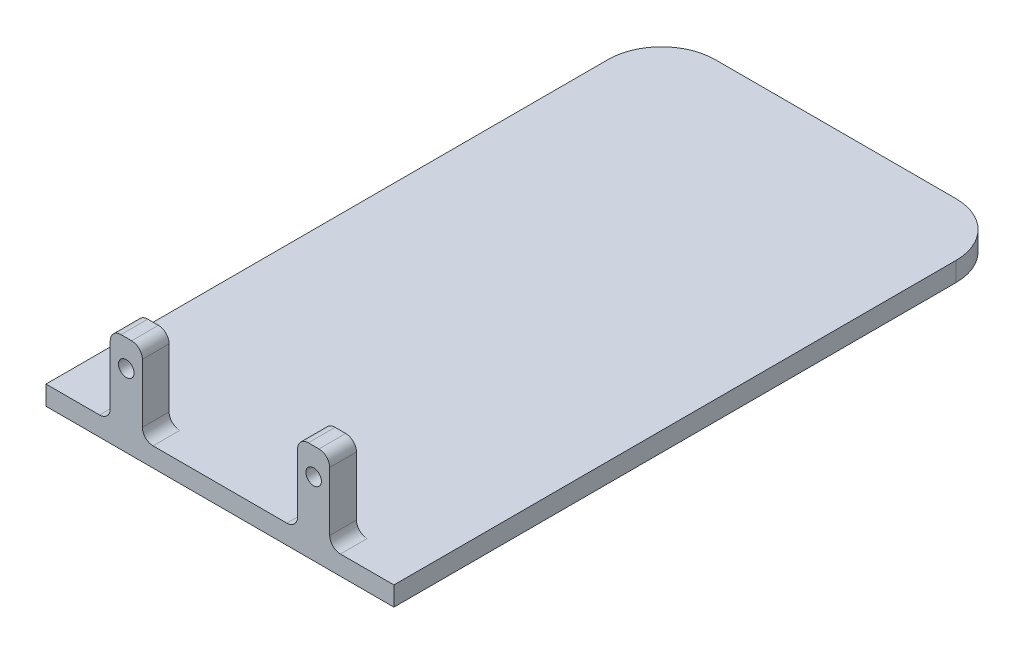
ISO-10303-21;
HEADER;
FILE_DESCRIPTION(('STEP AP214'),'2;1');
FILE_NAME('part.step','',(''),(''),'','','');
FILE_SCHEMA(('AUTOMOTIVE_DESIGN { 1 0 10303 214 1 1 1 1 }'));
ENDSEC;
DATA;
#1=APPLICATION_CONTEXT('core data for automotive mechanical design processes');
#2=APPLICATION_PROTOCOL_DEFINITION('international standard','automotive_design',2000,#1);
#3=PRODUCT_CONTEXT('',#1,'mechanical');
#4=PRODUCT('Part','Part','',(#3));
#5=PRODUCT_RELATED_PRODUCT_CATEGORY('part','',(#4));
#6=PRODUCT_DEFINITION_FORMATION('','',#4);
#7=PRODUCT_DEFINITION_CONTEXT('part definition',#1,'design');
#8=PRODUCT_DEFINITION('design','',#6,#7);
#9=PRODUCT_DEFINITION_SHAPE('','',#8);
#10=(LENGTH_UNIT() NAMED_UNIT(*) SI_UNIT(.MILLI.,.METRE.));
#11=(NAMED_UNIT(*) PLANE_ANGLE_UNIT() SI_UNIT($,.RADIAN.));
#12=(NAMED_UNIT(*) SI_UNIT($,.STERADIAN.) SOLID_ANGLE_UNIT());
#13=UNCERTAINTY_MEASURE_WITH_UNIT(LENGTH_MEASURE(1.E-05),#10,'distance_accuracy_value','');
#14=(GEOMETRIC_REPRESENTATION_CONTEXT(3) GLOBAL_UNCERTAINTY_ASSIGNED_CONTEXT((#13)) GLOBAL_UNIT_ASSIGNED_CONTEXT((#10,
#11,#12)) REPRESENTATION_CONTEXT('',''));
#15=CARTESIAN_POINT('',(0.,0.,0.));
#16=DIRECTION('',(0.,0.,1.));
#17=DIRECTION('',(1.,0.,0.));
#18=AXIS2_PLACEMENT_3D('',#15,#16,#17);
#19=CARTESIAN_POINT('',(-38.0503105288509,3.6,-26.0406812681823));
#20=DIRECTION('',(1.,0.,0.));
#21=DIRECTION('',(0.,0.,-1.));
#22=AXIS2_PLACEMENT_3D('',#19,#20,#21);
#23=PLANE('',#22);
#24=DIRECTION('',(0.,0.,1.));
#25=VECTOR('',#24,1.);
#26=CARTESIAN_POINT('',(-38.0503105288509,3.6,-26.0406812681823));
#27=LINE('',#26,#25);
#28=CARTESIAN_POINT('',(-38.0503105288509,3.6,-16.0406812681823));
#29=VERTEX_POINT('',#28);
#30=CARTESIAN_POINT('',(-38.0503105288509,3.6,88.9593187318177));
#31=VERTEX_POINT('',#30);
#32=EDGE_CURVE('E183',#29,#31,#27,.T.);
#33=ORIENTED_EDGE('',*,*,#32,.F.);
#34=DIRECTION('',(0.,-1.,0.));
#35=VECTOR('',#34,1.);
#36=CARTESIAN_POINT('',(-38.0503105288509,3.6,-16.0406812681823));
#37=LINE('',#36,#35);
#38=CARTESIAN_POINT('',(-38.0503105288509,0.,-16.0406812681823));
#39=VERTEX_POINT('',#38);
#40=EDGE_CURVE('E233',#29,#39,#37,.T.);
#41=ORIENTED_EDGE('',*,*,#40,.T.);
#42=DIRECTION('',(0.,0.,1.));
#43=VECTOR('',#42,1.);
#44=CARTESIAN_POINT('',(-38.0503105288509,0.,-26.0406812681823));
#45=LINE('',#44,#43);
#46=CARTESIAN_POINT('',(-38.0503105288509,0.,88.9593187318177));
#47=VERTEX_POINT('',#46);
#48=EDGE_CURVE('E210',#39,#47,#45,.T.);
#49=ORIENTED_EDGE('',*,*,#48,.T.);
#50=DIRECTION('',(0.,-1.,0.));
#51=VECTOR('',#50,1.);
#52=CARTESIAN_POINT('',(-38.0503105288509,3.6,88.9593187318177));
#53=LINE('',#52,#51);
#54=EDGE_CURVE('E204',#31,#47,#53,.T.);
#55=ORIENTED_EDGE('',*,*,#54,.F.);
#56=EDGE_LOOP('',(#33,#41,#49,#55));
#57=FACE_BOUND('',#56,.T.);
#58=ADVANCED_FACE('F33',(#57),#23,.F.);
#59=CARTESIAN_POINT('',(-38.0503105288509,3.6,88.9593187318177));
#60=DIRECTION('',(0.,0.,-1.));
#61=DIRECTION('',(-1.,0.,0.));
#62=AXIS2_PLACEMENT_3D('',#59,#60,#61);
#63=PLANE('',#62);
#64=DIRECTION('',(-1.,0.,0.));
#65=VECTOR('',#64,1.);
#66=CARTESIAN_POINT('',(14.9496894711491,18.6,88.9593187318177));
#67=LINE('',#66,#65);
#68=CARTESIAN_POINT('',(12.9496894711491,18.6,88.9593187318177));
#69=VERTEX_POINT('',#68);
#70=CARTESIAN_POINT('',(10.9496894711491,18.6,88.9593187318177));
#71=VERTEX_POINT('',#70);
#72=EDGE_CURVE('E424',#69,#71,#67,.T.);
#73=ORIENTED_EDGE('',*,*,#72,.T.);
#74=CARTESIAN_POINT('',(10.9496894711491,16.6,88.9593187318177));
#75=DIRECTION('',(0.,0.,-1.));
#76=DIRECTION('',(-1.,0.,0.));
#77=AXIS2_PLACEMENT_3D('',#74,#75,#76);
#78=CIRCLE('',#77,2.);
#79=CARTESIAN_POINT('',(8.9496894711491,16.6,88.9593187318177));
#80=VERTEX_POINT('',#79);
#81=EDGE_CURVE('E277',#71,#80,#78,.F.);
#82=ORIENTED_EDGE('',*,*,#81,.T.);
#83=DIRECTION('',(0.,-1.,0.));
#84=VECTOR('',#83,1.);
#85=CARTESIAN_POINT('',(8.9496894711491,3.6,88.9593187318177));
#86=LINE('',#85,#84);
#87=CARTESIAN_POINT('',(8.9496894711491,5.6,88.9593187318177));
#88=VERTEX_POINT('',#87);
#89=EDGE_CURVE('E324',#80,#88,#86,.T.);
#90=ORIENTED_EDGE('',*,*,#89,.T.);
#91=CARTESIAN_POINT('',(6.9496894711491,5.6,88.9593187318177));
#92=DIRECTION('',(0.,0.,-1.));
#93=DIRECTION('',(-1.,0.,0.));
#94=AXIS2_PLACEMENT_3D('',#91,#92,#93);
#95=CIRCLE('',#94,2.);
#96=CARTESIAN_POINT('',(6.9496894711491,3.6,88.9593187318177));
#97=VERTEX_POINT('',#96);
#98=EDGE_CURVE('E300',#88,#97,#95,.T.);
#99=ORIENTED_EDGE('',*,*,#98,.T.);
#100=DIRECTION('',(1.,0.,0.));
#101=VECTOR('',#100,1.);
#102=CARTESIAN_POINT('',(-38.0503105288509,3.6,88.9593187318177));
#103=LINE('',#102,#101);
#104=CARTESIAN_POINT('',(-18.0503105288509,3.6,88.9593187318177));
#105=VERTEX_POINT('',#104);
#106=EDGE_CURVE('E207',#105,#97,#103,.T.);
#107=ORIENTED_EDGE('',*,*,#106,.F.);
#108=CARTESIAN_POINT('',(-18.0503105288509,5.6,88.9593187318177));
#109=DIRECTION('',(0.,0.,-1.));
#110=DIRECTION('',(-1.,0.,0.));
#111=AXIS2_PLACEMENT_3D('',#108,#109,#110);
#112=CIRCLE('',#111,2.);
#113=CARTESIAN_POINT('',(-20.0503105288509,5.6,88.9593187318177));
#114=VERTEX_POINT('',#113);
#115=EDGE_CURVE('E295',#105,#114,#112,.T.);
#116=ORIENTED_EDGE('',*,*,#115,.T.);
#117=DIRECTION('',(0.,1.,0.));
#118=VECTOR('',#117,1.);
#119=CARTESIAN_POINT('',(-20.0503105288509,3.6,88.9593187318177));
#120=LINE('',#119,#118);
#121=CARTESIAN_POINT('',(-20.0503105288509,16.6,88.9593187318177));
#122=VERTEX_POINT('',#121);
#123=EDGE_CURVE('E455',#114,#122,#120,.T.);
#124=ORIENTED_EDGE('',*,*,#123,.T.);
#125=CARTESIAN_POINT('',(-22.0503105288509,16.6,88.9593187318177));
#126=DIRECTION('',(0.,0.,-1.));
#127=DIRECTION('',(-1.,0.,0.));
#128=AXIS2_PLACEMENT_3D('',#125,#126,#127);
#129=CIRCLE('',#128,2.);
#130=CARTESIAN_POINT('',(-22.0503105288509,18.6,88.9593187318177));
#131=VERTEX_POINT('',#130);
#132=EDGE_CURVE('E273',#122,#131,#129,.F.);
#133=ORIENTED_EDGE('',*,*,#132,.T.);
#134=DIRECTION('',(-1.,0.,0.));
#135=VECTOR('',#134,1.);
#136=CARTESIAN_POINT('',(-26.0503105288509,18.6,88.9593187318177));
#137=LINE('',#136,#135);
#138=CARTESIAN_POINT('',(-24.0503105288509,18.6,88.9593187318177));
#139=VERTEX_POINT('',#138);
#140=EDGE_CURVE('E448',#131,#139,#137,.T.);
#141=ORIENTED_EDGE('',*,*,#140,.T.);
#142=CARTESIAN_POINT('',(-24.0503105288509,16.6,88.9593187318177));
#143=DIRECTION('',(0.,0.,-1.));
#144=DIRECTION('',(-1.,0.,0.));
#145=AXIS2_PLACEMENT_3D('',#142,#143,#144);
#146=CIRCLE('',#145,2.);
#147=CARTESIAN_POINT('',(-26.0503105288509,16.6,88.9593187318177));
#148=VERTEX_POINT('',#147);
#149=EDGE_CURVE('E271',#139,#148,#146,.F.);
#150=ORIENTED_EDGE('',*,*,#149,.T.);
#151=DIRECTION('',(0.,-1.,0.));
#152=VECTOR('',#151,1.);
#153=CARTESIAN_POINT('',(-26.0503105288509,3.6,88.9593187318177));
#154=LINE('',#153,#152);
#155=CARTESIAN_POINT('',(-26.0503105288509,5.6,88.9593187318177));
#156=VERTEX_POINT('',#155);
#157=EDGE_CURVE('E441',#148,#156,#154,.T.);
#158=ORIENTED_EDGE('',*,*,#157,.T.);
#159=CARTESIAN_POINT('',(-28.0503105288509,5.6,88.9593187318177));
#160=DIRECTION('',(0.,0.,-1.));
#161=DIRECTION('',(-1.,0.,0.));
#162=AXIS2_PLACEMENT_3D('',#159,#160,#161);
#163=CIRCLE('',#162,2.);
#164=CARTESIAN_POINT('',(-28.0503105288509,3.6,88.9593187318177));
#165=VERTEX_POINT('',#164);
#166=EDGE_CURVE('E41',#156,#165,#163,.T.);
#167=ORIENTED_EDGE('',*,*,#166,.T.);
#168=EDGE_CURVE('E187',#31,#165,#103,.T.);
#169=ORIENTED_EDGE('',*,*,#168,.F.);
#170=ORIENTED_EDGE('',*,*,#54,.T.);
#171=DIRECTION('',(1.,0.,0.));
#172=VECTOR('',#171,1.);
#173=CARTESIAN_POINT('',(-38.0503105288509,0.,88.9593187318177));
#174=LINE('',#173,#172);
#175=CARTESIAN_POINT('',(26.9496894711491,0.,88.9593187318177));
#176=VERTEX_POINT('',#175);
#177=EDGE_CURVE('E332',#47,#176,#174,.T.);
#178=ORIENTED_EDGE('',*,*,#177,.T.);
#179=DIRECTION('',(0.,-1.,0.));
#180=VECTOR('',#179,1.);
#181=CARTESIAN_POINT('',(26.9496894711491,3.6,88.9593187318177));
#182=LINE('',#181,#180);
#183=CARTESIAN_POINT('',(26.9496894711491,3.6,88.9593187318177));
#184=VERTEX_POINT('',#183);
#185=EDGE_CURVE('E213',#184,#176,#182,.T.);
#186=ORIENTED_EDGE('',*,*,#185,.F.);
#187=CARTESIAN_POINT('',(16.9496894711491,3.6,88.9593187318177));
#188=VERTEX_POINT('',#187);
#189=EDGE_CURVE('E196',#188,#184,#103,.T.);
#190=ORIENTED_EDGE('',*,*,#189,.F.);
#191=CARTESIAN_POINT('',(16.9496894711491,5.6,88.9593187318177));
#192=DIRECTION('',(0.,0.,-1.));
#193=DIRECTION('',(-1.,0.,0.));
#194=AXIS2_PLACEMENT_3D('',#191,#192,#193);
#195=CIRCLE('',#194,2.);
#196=CARTESIAN_POINT('',(14.9496894711491,5.6,88.9593187318177));
#197=VERTEX_POINT('',#196);
#198=EDGE_CURVE('E290',#188,#197,#195,.T.);
#199=ORIENTED_EDGE('',*,*,#198,.T.);
#200=DIRECTION('',(0.,1.,0.));
#201=VECTOR('',#200,1.);
#202=CARTESIAN_POINT('',(14.9496894711491,3.6,88.9593187318177));
#203=LINE('',#202,#201);
#204=CARTESIAN_POINT('',(14.9496894711491,16.6,88.9593187318177));
#205=VERTEX_POINT('',#204);
#206=EDGE_CURVE('E420',#197,#205,#203,.T.);
#207=ORIENTED_EDGE('',*,*,#206,.T.);
#208=CARTESIAN_POINT('',(12.9496894711491,16.6,88.9593187318177));
#209=DIRECTION('',(0.,0.,-1.));
#210=DIRECTION('',(-1.,0.,0.));
#211=AXIS2_PLACEMENT_3D('',#208,#209,#210);
#212=CIRCLE('',#211,2.);
#213=EDGE_CURVE('E275',#205,#69,#212,.F.);
#214=ORIENTED_EDGE('',*,*,#213,.T.);
#215=EDGE_LOOP('',(#73,#82,#90,#99,#107,#116,#124,#133,#141,#150,#158,#167,#169,#170,#178,#186,
#190,#199,#207,#214));
#216=FACE_BOUND('',#215,.T.);
#217=CARTESIAN_POINT('',(-23.0503105288509,13.6,88.9593187318177));
#218=DIRECTION('',(0.,0.,1.));
#219=DIRECTION('',(1.,0.,0.));
#220=AXIS2_PLACEMENT_3D('',#217,#218,#219);
#221=CIRCLE('',#220,1.45);
#222=CARTESIAN_POINT('',(-21.6003105288509,13.6,88.9593187318177));
#223=VERTEX_POINT('',#222);
#224=EDGE_CURVE('E434',#223,#223,#221,.T.);
#225=ORIENTED_EDGE('',*,*,#224,.F.);
#226=EDGE_LOOP('',(#225));
#227=FACE_BOUND('',#226,.T.);
#228=CARTESIAN_POINT('',(11.9496894711491,13.6,88.9593187318177));
#229=DIRECTION('',(0.,0.,1.));
#230=DIRECTION('',(-1.,0.,0.));
#231=AXIS2_PLACEMENT_3D('',#228,#229,#230);
#232=CIRCLE('',#231,1.45);
#233=CARTESIAN_POINT('',(10.4996894711491,13.6,88.9593187318177));
#234=VERTEX_POINT('',#233);
#235=EDGE_CURVE('E421',#234,#234,#232,.T.);
#236=ORIENTED_EDGE('',*,*,#235,.F.);
#237=EDGE_LOOP('',(#236));
#238=FACE_BOUND('',#237,.T.);
#239=ADVANCED_FACE('F202',(#216,#227,#238),#63,.F.);
#240=CARTESIAN_POINT('',(26.9496894711491,3.6,-26.0406812681823));
#241=DIRECTION('',(-1.,0.,0.));
#242=DIRECTION('',(0.,0.,1.));
#243=AXIS2_PLACEMENT_3D('',#240,#241,#242);
#244=PLANE('',#243);
#245=DIRECTION('',(0.,0.,-1.));
#246=VECTOR('',#245,1.);
#247=CARTESIAN_POINT('',(26.9496894711491,0.,-26.0406812681823));
#248=LINE('',#247,#246);
#249=CARTESIAN_POINT('',(26.9496894711491,0.,-16.0406812681823));
#250=VERTEX_POINT('',#249);
#251=EDGE_CURVE('E335',#176,#250,#248,.T.);
#252=ORIENTED_EDGE('',*,*,#251,.T.);
#253=DIRECTION('',(0.,-1.,0.));
#254=VECTOR('',#253,1.);
#255=CARTESIAN_POINT('',(26.9496894711491,3.6,-16.0406812681823));
#256=LINE('',#255,#254);
#257=CARTESIAN_POINT('',(26.9496894711491,3.6,-16.0406812681823));
#258=VERTEX_POINT('',#257);
#259=EDGE_CURVE('E228',#250,#258,#256,.F.);
#260=ORIENTED_EDGE('',*,*,#259,.T.);
#261=DIRECTION('',(0.,0.,-1.));
#262=VECTOR('',#261,1.);
#263=CARTESIAN_POINT('',(26.9496894711491,3.6,-26.0406812681823));
#264=LINE('',#263,#262);
#265=EDGE_CURVE('E206',#184,#258,#264,.T.);
#266=ORIENTED_EDGE('',*,*,#265,.F.);
#267=ORIENTED_EDGE('',*,*,#185,.T.);
#268=EDGE_LOOP('',(#252,#260,#266,#267));
#269=FACE_BOUND('',#268,.T.);
#270=ADVANCED_FACE('F353',(#269),#244,.F.);
#271=CARTESIAN_POINT('',(-38.0503105288509,3.6,-26.0406812681823));
#272=DIRECTION('',(0.,0.,1.));
#273=DIRECTION('',(1.,0.,0.));
#274=AXIS2_PLACEMENT_3D('',#271,#272,#273);
#275=PLANE('',#274);
#276=DIRECTION('',(-1.,0.,0.));
#277=VECTOR('',#276,1.);
#278=CARTESIAN_POINT('',(-38.0503105288509,3.6,-26.0406812681823));
#279=LINE('',#278,#277);
#280=CARTESIAN_POINT('',(16.9496894711491,3.6,-26.0406812681823));
#281=VERTEX_POINT('',#280);
#282=CARTESIAN_POINT('',(-28.0503105288509,3.6,-26.0406812681823));
#283=VERTEX_POINT('',#282);
#284=EDGE_CURVE('E218',#281,#283,#279,.T.);
#285=ORIENTED_EDGE('',*,*,#284,.F.);
#286=DIRECTION('',(0.,-1.,0.));
#287=VECTOR('',#286,1.);
#288=CARTESIAN_POINT('',(16.9496894711491,3.6,-26.0406812681823));
#289=LINE('',#288,#287);
#290=CARTESIAN_POINT('',(16.9496894711491,0.,-26.0406812681823));
#291=VERTEX_POINT('',#290);
#292=EDGE_CURVE('E215',#281,#291,#289,.T.);
#293=ORIENTED_EDGE('',*,*,#292,.T.);
#294=DIRECTION('',(-1.,0.,0.));
#295=VECTOR('',#294,1.);
#296=CARTESIAN_POINT('',(-38.0503105288509,0.,-26.0406812681823));
#297=LINE('',#296,#295);
#298=CARTESIAN_POINT('',(-28.0503105288509,0.,-26.0406812681823));
#299=VERTEX_POINT('',#298);
#300=EDGE_CURVE('E197',#291,#299,#297,.T.);
#301=ORIENTED_EDGE('',*,*,#300,.T.);
#302=DIRECTION('',(0.,-1.,0.));
#303=VECTOR('',#302,1.);
#304=CARTESIAN_POINT('',(-28.0503105288509,3.6,-26.0406812681823));
#305=LINE('',#304,#303);
#306=EDGE_CURVE('E212',#299,#283,#305,.F.);
#307=ORIENTED_EDGE('',*,*,#306,.T.);
#308=EDGE_LOOP('',(#285,#293,#301,#307));
#309=FACE_BOUND('',#308,.T.);
#310=ADVANCED_FACE('F342',(#309),#275,.F.);
#311=CARTESIAN_POINT('',(0.,3.6,0.));
#312=DIRECTION('',(0.,1.,0.));
#313=DIRECTION('',(0.,0.,1.));
#314=AXIS2_PLACEMENT_3D('',#311,#312,#313);
#315=PLANE('',#314);
#316=DIRECTION('',(1.,0.,0.));
#317=VECTOR('',#316,1.);
#318=CARTESIAN_POINT('',(14.9496894711491,3.6,83.9593187318177));
#319=LINE('',#318,#317);
#320=CARTESIAN_POINT('',(6.9496894711491,3.6,83.9593187318177));
#321=VERTEX_POINT('',#320);
#322=CARTESIAN_POINT('',(16.9496894711491,3.6,83.9593187318177));
#323=VERTEX_POINT('',#322);
#324=EDGE_CURVE('E310',#321,#323,#319,.T.);
#325=ORIENTED_EDGE('',*,*,#324,.T.);
#326=DIRECTION('',(0.,0.,1.));
#327=VECTOR('',#326,1.);
#328=CARTESIAN_POINT('',(16.9496894711491,3.6,88.9593187318177));
#329=LINE('',#328,#327);
#330=EDGE_CURVE('E243',#323,#188,#329,.T.);
#331=ORIENTED_EDGE('',*,*,#330,.T.);
#332=ORIENTED_EDGE('',*,*,#189,.T.);
#333=ORIENTED_EDGE('',*,*,#265,.T.);
#334=CARTESIAN_POINT('',(16.9496894711491,3.6,-16.0406812681823));
#335=DIRECTION('',(0.,1.,0.));
#336=DIRECTION('',(0.,0.,1.));
#337=AXIS2_PLACEMENT_3D('',#334,#335,#336);
#338=CIRCLE('',#337,10.);
#339=EDGE_CURVE('E231',#258,#281,#338,.T.);
#340=ORIENTED_EDGE('',*,*,#339,.T.);
#341=ORIENTED_EDGE('',*,*,#284,.T.);
#342=CARTESIAN_POINT('',(-28.0503105288509,3.6,-16.0406812681823));
#343=DIRECTION('',(0.,1.,0.));
#344=DIRECTION('',(0.,0.,1.));
#345=AXIS2_PLACEMENT_3D('',#342,#343,#344);
#346=CIRCLE('',#345,10.);
#347=EDGE_CURVE('E191',#283,#29,#346,.T.);
#348=ORIENTED_EDGE('',*,*,#347,.T.);
#349=ORIENTED_EDGE('',*,*,#32,.T.);
#350=ORIENTED_EDGE('',*,*,#168,.T.);
#351=DIRECTION('',(0.,0.,1.));
#352=VECTOR('',#351,1.);
#353=CARTESIAN_POINT('',(-28.0503105288509,3.6,83.9593187318177));
#354=LINE('',#353,#352);
#355=CARTESIAN_POINT('',(-28.0503105288509,3.6,83.9593187318177));
#356=VERTEX_POINT('',#355);
#357=EDGE_CURVE('E235',#165,#356,#354,.F.);
#358=ORIENTED_EDGE('',*,*,#357,.T.);
#359=DIRECTION('',(1.,0.,0.));
#360=VECTOR('',#359,1.);
#361=CARTESIAN_POINT('',(-26.0503105288509,3.6,83.9593187318177));
#362=LINE('',#361,#360);
#363=CARTESIAN_POINT('',(-18.0503105288509,3.6,83.9593187318177));
#364=VERTEX_POINT('',#363);
#365=EDGE_CURVE('E447',#356,#364,#362,.T.);
#366=ORIENTED_EDGE('',*,*,#365,.T.);
#367=DIRECTION('',(0.,0.,1.));
#368=VECTOR('',#367,1.);
#369=CARTESIAN_POINT('',(-18.0503105288509,3.6,88.9593187318177));
#370=LINE('',#369,#368);
#371=EDGE_CURVE('E240',#364,#105,#370,.T.);
#372=ORIENTED_EDGE('',*,*,#371,.T.);
#373=ORIENTED_EDGE('',*,*,#106,.T.);
#374=DIRECTION('',(0.,0.,1.));
#375=VECTOR('',#374,1.);
#376=CARTESIAN_POINT('',(6.9496894711491,3.6,83.9593187318177));
#377=LINE('',#376,#375);
#378=EDGE_CURVE('E237',#97,#321,#377,.F.);
#379=ORIENTED_EDGE('',*,*,#378,.T.);
#380=EDGE_LOOP('',(#325,#331,#332,#333,#340,#341,#348,#349,#350,#358,#366,#372,#373,#379));
#381=FACE_BOUND('',#380,.T.);
#382=ADVANCED_FACE('F185',(#381),#315,.T.);
#383=CARTESIAN_POINT('',(0.,0.,0.));
#384=DIRECTION('',(0.,1.,0.));
#385=DIRECTION('',(0.,0.,1.));
#386=AXIS2_PLACEMENT_3D('',#383,#384,#385);
#387=PLANE('',#386);
#388=ORIENTED_EDGE('',*,*,#300,.F.);
#389=CARTESIAN_POINT('',(16.9496894711491,0.,-16.0406812681823));
#390=DIRECTION('',(0.,1.,0.));
#391=DIRECTION('',(0.,0.,1.));
#392=AXIS2_PLACEMENT_3D('',#389,#390,#391);
#393=CIRCLE('',#392,10.);
#394=EDGE_CURVE('E226',#291,#250,#393,.F.);
#395=ORIENTED_EDGE('',*,*,#394,.T.);
#396=ORIENTED_EDGE('',*,*,#251,.F.);
#397=ORIENTED_EDGE('',*,*,#177,.F.);
#398=ORIENTED_EDGE('',*,*,#48,.F.);
#399=CARTESIAN_POINT('',(-28.0503105288509,0.,-16.0406812681823));
#400=DIRECTION('',(0.,1.,0.));
#401=DIRECTION('',(0.,0.,1.));
#402=AXIS2_PLACEMENT_3D('',#399,#400,#401);
#403=CIRCLE('',#402,10.);
#404=EDGE_CURVE('E224',#39,#299,#403,.F.);
#405=ORIENTED_EDGE('',*,*,#404,.T.);
#406=EDGE_LOOP('',(#388,#395,#396,#397,#398,#405));
#407=FACE_BOUND('',#406,.T.);
#408=ADVANCED_FACE('F347',(#407),#387,.F.);
#409=CARTESIAN_POINT('',(-26.0503105288509,3.6,83.9593187318177));
#410=DIRECTION('',(-1.,0.,0.));
#411=DIRECTION('',(0.,0.,1.));
#412=AXIS2_PLACEMENT_3D('',#409,#410,#411);
#413=PLANE('',#412);
#414=DIRECTION('',(0.,-1.,0.));
#415=VECTOR('',#414,1.);
#416=CARTESIAN_POINT('',(-26.0503105288509,3.6,83.9593187318177));
#417=LINE('',#416,#415);
#418=CARTESIAN_POINT('',(-26.0503105288509,16.6,83.9593187318177));
#419=VERTEX_POINT('',#418);
#420=CARTESIAN_POINT('',(-26.0503105288509,5.6,83.9593187318177));
#421=VERTEX_POINT('',#420);
#422=EDGE_CURVE('E444',#419,#421,#417,.T.);
#423=ORIENTED_EDGE('',*,*,#422,.T.);
#424=DIRECTION('',(0.,0.,1.));
#425=VECTOR('',#424,1.);
#426=CARTESIAN_POINT('',(-26.0503105288509,5.6,88.9593187318177));
#427=LINE('',#426,#425);
#428=EDGE_CURVE('E263',#421,#156,#427,.T.);
#429=ORIENTED_EDGE('',*,*,#428,.T.);
#430=ORIENTED_EDGE('',*,*,#157,.F.);
#431=DIRECTION('',(0.,0.,1.));
#432=VECTOR('',#431,1.);
#433=CARTESIAN_POINT('',(-26.0503105288509,16.6,83.9593187318177));
#434=LINE('',#433,#432);
#435=EDGE_CURVE('E261',#148,#419,#434,.F.);
#436=ORIENTED_EDGE('',*,*,#435,.T.);
#437=EDGE_LOOP('',(#423,#429,#430,#436));
#438=FACE_BOUND('',#437,.T.);
#439=ADVANCED_FACE('F382',(#438),#413,.T.);
#440=CARTESIAN_POINT('',(-26.0503105288509,18.6,83.9593187318177));
#441=DIRECTION('',(0.,1.,0.));
#442=DIRECTION('',(0.,0.,1.));
#443=AXIS2_PLACEMENT_3D('',#440,#441,#442);
#444=PLANE('',#443);
#445=ORIENTED_EDGE('',*,*,#140,.F.);
#446=DIRECTION('',(0.,0.,1.));
#447=VECTOR('',#446,1.);
#448=CARTESIAN_POINT('',(-22.0503105288509,18.6,83.9593187318177));
#449=LINE('',#448,#447);
#450=CARTESIAN_POINT('',(-22.0503105288509,18.6,83.9593187318177));
#451=VERTEX_POINT('',#450);
#452=EDGE_CURVE('E55',#131,#451,#449,.F.);
#453=ORIENTED_EDGE('',*,*,#452,.T.);
#454=DIRECTION('',(-1.,0.,0.));
#455=VECTOR('',#454,1.);
#456=CARTESIAN_POINT('',(-26.0503105288509,18.6,83.9593187318177));
#457=LINE('',#456,#455);
#458=CARTESIAN_POINT('',(-24.0503105288509,18.6,83.9593187318177));
#459=VERTEX_POINT('',#458);
#460=EDGE_CURVE('E333',#451,#459,#457,.T.);
#461=ORIENTED_EDGE('',*,*,#460,.T.);
#462=DIRECTION('',(0.,0.,1.));
#463=VECTOR('',#462,1.);
#464=CARTESIAN_POINT('',(-24.0503105288509,18.6,83.9593187318177));
#465=LINE('',#464,#463);
#466=EDGE_CURVE('E283',#459,#139,#465,.T.);
#467=ORIENTED_EDGE('',*,*,#466,.T.);
#468=EDGE_LOOP('',(#445,#453,#461,#467));
#469=FACE_BOUND('',#468,.T.);
#470=ADVANCED_FACE('F387',(#469),#444,.T.);
#471=CARTESIAN_POINT('',(-20.0503105288509,3.6,83.9593187318177));
#472=DIRECTION('',(1.,0.,0.));
#473=DIRECTION('',(0.,0.,-1.));
#474=AXIS2_PLACEMENT_3D('',#471,#472,#473);
#475=PLANE('',#474);
#476=ORIENTED_EDGE('',*,*,#123,.F.);
#477=DIRECTION('',(0.,0.,1.));
#478=VECTOR('',#477,1.);
#479=CARTESIAN_POINT('',(-20.0503105288509,5.6,83.9593187318177));
#480=LINE('',#479,#478);
#481=CARTESIAN_POINT('',(-20.0503105288509,5.6,83.9593187318177));
#482=VERTEX_POINT('',#481);
#483=EDGE_CURVE('E254',#114,#482,#480,.F.);
#484=ORIENTED_EDGE('',*,*,#483,.T.);
#485=DIRECTION('',(0.,1.,0.));
#486=VECTOR('',#485,1.);
#487=CARTESIAN_POINT('',(-20.0503105288509,3.6,83.9593187318177));
#488=LINE('',#487,#486);
#489=CARTESIAN_POINT('',(-20.0503105288509,16.6,83.9593187318177));
#490=VERTEX_POINT('',#489);
#491=EDGE_CURVE('E450',#482,#490,#488,.T.);
#492=ORIENTED_EDGE('',*,*,#491,.T.);
#493=DIRECTION('',(0.,0.,1.));
#494=VECTOR('',#493,1.);
#495=CARTESIAN_POINT('',(-20.0503105288509,16.6,83.9593187318177));
#496=LINE('',#495,#494);
#497=EDGE_CURVE('E251',#490,#122,#496,.T.);
#498=ORIENTED_EDGE('',*,*,#497,.T.);
#499=EDGE_LOOP('',(#476,#484,#492,#498));
#500=FACE_BOUND('',#499,.T.);
#501=ADVANCED_FACE('F389',(#500),#475,.T.);
#502=CARTESIAN_POINT('',(0.,0.,83.9593187318177));
#503=DIRECTION('',(0.,0.,-1.));
#504=DIRECTION('',(-1.,0.,0.));
#505=AXIS2_PLACEMENT_3D('',#502,#503,#504);
#506=PLANE('',#505);
#507=CARTESIAN_POINT('',(-23.0503105288509,13.6,83.9593187318177));
#508=DIRECTION('',(0.,0.,1.));
#509=DIRECTION('',(1.,0.,0.));
#510=AXIS2_PLACEMENT_3D('',#507,#508,#509);
#511=CIRCLE('',#510,1.45);
#512=CARTESIAN_POINT('',(-21.6003105288509,13.6,83.9593187318177));
#513=VERTEX_POINT('',#512);
#514=EDGE_CURVE('E438',#513,#513,#511,.T.);
#515=ORIENTED_EDGE('',*,*,#514,.T.);
#516=EDGE_LOOP('',(#515));
#517=FACE_BOUND('',#516,.T.);
#518=ORIENTED_EDGE('',*,*,#460,.F.);
#519=CARTESIAN_POINT('',(-22.0503105288509,16.6,83.9593187318177));
#520=DIRECTION('',(0.,0.,-1.));
#521=DIRECTION('',(-1.,0.,0.));
#522=AXIS2_PLACEMENT_3D('',#519,#520,#521);
#523=CIRCLE('',#522,2.);
#524=EDGE_CURVE('E288',#451,#490,#523,.T.);
#525=ORIENTED_EDGE('',*,*,#524,.T.);
#526=ORIENTED_EDGE('',*,*,#491,.F.);
#527=CARTESIAN_POINT('',(-18.0503105288509,5.6,83.9593187318177));
#528=DIRECTION('',(0.,0.,-1.));
#529=DIRECTION('',(-1.,0.,0.));
#530=AXIS2_PLACEMENT_3D('',#527,#528,#529);
#531=CIRCLE('',#530,2.);
#532=EDGE_CURVE('E297',#482,#364,#531,.F.);
#533=ORIENTED_EDGE('',*,*,#532,.T.);
#534=ORIENTED_EDGE('',*,*,#365,.F.);
#535=CARTESIAN_POINT('',(-28.0503105288509,5.6,83.9593187318177));
#536=DIRECTION('',(0.,0.,-1.));
#537=DIRECTION('',(-1.,0.,0.));
#538=AXIS2_PLACEMENT_3D('',#535,#536,#537);
#539=CIRCLE('',#538,2.);
#540=EDGE_CURVE('E11',#356,#421,#539,.F.);
#541=ORIENTED_EDGE('',*,*,#540,.T.);
#542=ORIENTED_EDGE('',*,*,#422,.F.);
#543=CARTESIAN_POINT('',(-24.0503105288509,16.6,83.9593187318177));
#544=DIRECTION('',(0.,0.,-1.));
#545=DIRECTION('',(-1.,0.,0.));
#546=AXIS2_PLACEMENT_3D('',#543,#544,#545);
#547=CIRCLE('',#546,2.);
#548=EDGE_CURVE('E48',#419,#459,#547,.T.);
#549=ORIENTED_EDGE('',*,*,#548,.T.);
#550=EDGE_LOOP('',(#518,#525,#526,#533,#534,#541,#542,#549));
#551=FACE_BOUND('',#550,.T.);
#552=ADVANCED_FACE('F392',(#517,#551),#506,.T.);
#553=CARTESIAN_POINT('',(-23.0503105288509,13.6,83.9593187318177));
#554=DIRECTION('',(0.,0.,1.));
#555=DIRECTION('',(1.,0.,0.));
#556=AXIS2_PLACEMENT_3D('',#553,#554,#555);
#557=CYLINDRICAL_SURFACE('',#556,1.45);
#558=ORIENTED_EDGE('',*,*,#514,.F.);
#559=EDGE_LOOP('',(#558));
#560=FACE_BOUND('',#559,.T.);
#561=ORIENTED_EDGE('',*,*,#224,.T.);
#562=EDGE_LOOP('',(#561));
#563=FACE_BOUND('',#562,.T.);
#564=ADVANCED_FACE('F398',(#560,#563),#557,.F.);
#565=CARTESIAN_POINT('',(14.9496894711491,3.6,83.9593187318177));
#566=DIRECTION('',(1.,0.,0.));
#567=DIRECTION('',(0.,0.,-1.));
#568=AXIS2_PLACEMENT_3D('',#565,#566,#567);
#569=PLANE('',#568);
#570=ORIENTED_EDGE('',*,*,#206,.F.);
#571=DIRECTION('',(0.,0.,1.));
#572=VECTOR('',#571,1.);
#573=CARTESIAN_POINT('',(14.9496894711491,5.6,83.9593187318177));
#574=LINE('',#573,#572);
#575=CARTESIAN_POINT('',(14.9496894711491,5.6,83.9593187318177));
#576=VERTEX_POINT('',#575);
#577=EDGE_CURVE('E249',#197,#576,#574,.F.);
#578=ORIENTED_EDGE('',*,*,#577,.T.);
#579=DIRECTION('',(0.,1.,0.));
#580=VECTOR('',#579,1.);
#581=CARTESIAN_POINT('',(14.9496894711491,3.6,83.9593187318177));
#582=LINE('',#581,#580);
#583=CARTESIAN_POINT('',(14.9496894711491,16.6,83.9593187318177));
#584=VERTEX_POINT('',#583);
#585=EDGE_CURVE('E429',#576,#584,#582,.T.);
#586=ORIENTED_EDGE('',*,*,#585,.T.);
#587=DIRECTION('',(0.,0.,1.));
#588=VECTOR('',#587,1.);
#589=CARTESIAN_POINT('',(14.9496894711491,16.6,83.9593187318177));
#590=LINE('',#589,#588);
#591=EDGE_CURVE('E246',#584,#205,#590,.T.);
#592=ORIENTED_EDGE('',*,*,#591,.T.);
#593=EDGE_LOOP('',(#570,#578,#586,#592));
#594=FACE_BOUND('',#593,.T.);
#595=ADVANCED_FACE('F402',(#594),#569,.T.);
#596=CARTESIAN_POINT('',(8.9496894711491,3.6,83.9593187318177));
#597=DIRECTION('',(-1.,0.,0.));
#598=DIRECTION('',(0.,0.,1.));
#599=AXIS2_PLACEMENT_3D('',#596,#597,#598);
#600=PLANE('',#599);
#601=DIRECTION('',(0.,-1.,0.));
#602=VECTOR('',#601,1.);
#603=CARTESIAN_POINT('',(8.9496894711491,3.6,83.9593187318177));
#604=LINE('',#603,#602);
#605=CARTESIAN_POINT('',(8.9496894711491,16.6,83.9593187318177));
#606=VERTEX_POINT('',#605);
#607=CARTESIAN_POINT('',(8.9496894711491,5.6,83.9593187318177));
#608=VERTEX_POINT('',#607);
#609=EDGE_CURVE('E308',#606,#608,#604,.T.);
#610=ORIENTED_EDGE('',*,*,#609,.T.);
#611=DIRECTION('',(0.,0.,1.));
#612=VECTOR('',#611,1.);
#613=CARTESIAN_POINT('',(8.9496894711491,5.6,88.9593187318177));
#614=LINE('',#613,#612);
#615=EDGE_CURVE('E258',#608,#88,#614,.T.);
#616=ORIENTED_EDGE('',*,*,#615,.T.);
#617=ORIENTED_EDGE('',*,*,#89,.F.);
#618=DIRECTION('',(0.,0.,1.));
#619=VECTOR('',#618,1.);
#620=CARTESIAN_POINT('',(8.9496894711491,16.6,83.9593187318177));
#621=LINE('',#620,#619);
#622=EDGE_CURVE('E256',#80,#606,#621,.F.);
#623=ORIENTED_EDGE('',*,*,#622,.T.);
#624=EDGE_LOOP('',(#610,#616,#617,#623));
#625=FACE_BOUND('',#624,.T.);
#626=ADVANCED_FACE('F315',(#625),#600,.T.);
#627=CARTESIAN_POINT('',(14.9496894711491,18.6,83.9593187318177));
#628=DIRECTION('',(0.,1.,0.));
#629=DIRECTION('',(0.,0.,1.));
#630=AXIS2_PLACEMENT_3D('',#627,#628,#629);
#631=PLANE('',#630);
#632=DIRECTION('',(-1.,0.,0.));
#633=VECTOR('',#632,1.);
#634=CARTESIAN_POINT('',(14.9496894711491,18.6,83.9593187318177));
#635=LINE('',#634,#633);
#636=CARTESIAN_POINT('',(12.9496894711491,18.6,83.9593187318177));
#637=VERTEX_POINT('',#636);
#638=CARTESIAN_POINT('',(10.9496894711491,18.6,83.9593187318177));
#639=VERTEX_POINT('',#638);
#640=EDGE_CURVE('E319',#637,#639,#635,.T.);
#641=ORIENTED_EDGE('',*,*,#640,.T.);
#642=DIRECTION('',(0.,0.,1.));
#643=VECTOR('',#642,1.);
#644=CARTESIAN_POINT('',(10.9496894711491,18.6,83.9593187318177));
#645=LINE('',#644,#643);
#646=EDGE_CURVE('E268',#639,#71,#645,.T.);
#647=ORIENTED_EDGE('',*,*,#646,.T.);
#648=ORIENTED_EDGE('',*,*,#72,.F.);
#649=DIRECTION('',(0.,0.,1.));
#650=VECTOR('',#649,1.);
#651=CARTESIAN_POINT('',(12.9496894711491,18.6,83.9593187318177));
#652=LINE('',#651,#650);
#653=EDGE_CURVE('E266',#69,#637,#652,.F.);
#654=ORIENTED_EDGE('',*,*,#653,.T.);
#655=EDGE_LOOP('',(#641,#647,#648,#654));
#656=FACE_BOUND('',#655,.T.);
#657=ADVANCED_FACE('F407',(#656),#631,.T.);
#658=CARTESIAN_POINT('',(0.,0.,83.9593187318177));
#659=DIRECTION('',(0.,0.,1.));
#660=DIRECTION('',(1.,0.,0.));
#661=AXIS2_PLACEMENT_3D('',#658,#659,#660);
#662=PLANE('',#661);
#663=CARTESIAN_POINT('',(11.9496894711491,13.6,83.9593187318177));
#664=DIRECTION('',(0.,0.,1.));
#665=DIRECTION('',(-1.,0.,0.));
#666=AXIS2_PLACEMENT_3D('',#663,#664,#665);
#667=CIRCLE('',#666,1.45);
#668=CARTESIAN_POINT('',(10.4996894711491,13.6,83.9593187318177));
#669=VERTEX_POINT('',#668);
#670=EDGE_CURVE('E419',#669,#669,#667,.T.);
#671=ORIENTED_EDGE('',*,*,#670,.T.);
#672=EDGE_LOOP('',(#671));
#673=FACE_BOUND('',#672,.T.);
#674=ORIENTED_EDGE('',*,*,#609,.F.);
#675=CARTESIAN_POINT('',(10.9496894711491,16.6,83.9593187318177));
#676=DIRECTION('',(0.,0.,1.));
#677=DIRECTION('',(1.,0.,0.));
#678=AXIS2_PLACEMENT_3D('',#675,#676,#677);
#679=CIRCLE('',#678,2.);
#680=EDGE_CURVE('E281',#606,#639,#679,.F.);
#681=ORIENTED_EDGE('',*,*,#680,.T.);
#682=ORIENTED_EDGE('',*,*,#640,.F.);
#683=CARTESIAN_POINT('',(12.9496894711491,16.6,83.9593187318177));
#684=DIRECTION('',(0.,0.,1.));
#685=DIRECTION('',(1.,0.,0.));
#686=AXIS2_PLACEMENT_3D('',#683,#684,#685);
#687=CIRCLE('',#686,2.);
#688=EDGE_CURVE('E279',#637,#584,#687,.F.);
#689=ORIENTED_EDGE('',*,*,#688,.T.);
#690=ORIENTED_EDGE('',*,*,#585,.F.);
#691=CARTESIAN_POINT('',(16.9496894711491,5.6,83.9593187318177));
#692=DIRECTION('',(0.,0.,1.));
#693=DIRECTION('',(1.,0.,0.));
#694=AXIS2_PLACEMENT_3D('',#691,#692,#693);
#695=CIRCLE('',#694,2.);
#696=EDGE_CURVE('E292',#576,#323,#695,.T.);
#697=ORIENTED_EDGE('',*,*,#696,.T.);
#698=ORIENTED_EDGE('',*,*,#324,.F.);
#699=CARTESIAN_POINT('',(6.9496894711491,5.6,83.9593187318177));
#700=DIRECTION('',(0.,0.,1.));
#701=DIRECTION('',(1.,0.,0.));
#702=AXIS2_PLACEMENT_3D('',#699,#700,#701);
#703=CIRCLE('',#702,2.);
#704=EDGE_CURVE('E302',#321,#608,#703,.T.);
#705=ORIENTED_EDGE('',*,*,#704,.T.);
#706=EDGE_LOOP('',(#674,#681,#682,#689,#690,#697,#698,#705));
#707=FACE_BOUND('',#706,.T.);
#708=ADVANCED_FACE('F307',(#673,#707),#662,.F.);
#709=CARTESIAN_POINT('',(11.9496894711491,13.6,83.9593187318177));
#710=DIRECTION('',(0.,0.,1.));
#711=DIRECTION('',(1.,0.,0.));
#712=AXIS2_PLACEMENT_3D('',#709,#710,#711);
#713=CYLINDRICAL_SURFACE('',#712,1.45);
#714=ORIENTED_EDGE('',*,*,#670,.F.);
#715=EDGE_LOOP('',(#714));
#716=FACE_BOUND('',#715,.T.);
#717=ORIENTED_EDGE('',*,*,#235,.T.);
#718=EDGE_LOOP('',(#717));
#719=FACE_BOUND('',#718,.T.);
#720=ADVANCED_FACE('F359',(#716,#719),#713,.F.);
#721=CARTESIAN_POINT('',(16.9496894711491,3.6,-16.0406812681823));
#722=DIRECTION('',(0.,-1.,0.));
#723=DIRECTION('',(0.,0.,-1.));
#724=AXIS2_PLACEMENT_3D('',#721,#722,#723);
#725=CYLINDRICAL_SURFACE('',#724,10.);
#726=ORIENTED_EDGE('',*,*,#339,.F.);
#727=ORIENTED_EDGE('',*,*,#259,.F.);
#728=ORIENTED_EDGE('',*,*,#394,.F.);
#729=ORIENTED_EDGE('',*,*,#292,.F.);
#730=EDGE_LOOP('',(#726,#727,#728,#729));
#731=FACE_BOUND('',#730,.T.);
#732=ADVANCED_FACE('F357',(#731),#725,.T.);
#733=CARTESIAN_POINT('',(-28.0503105288509,3.6,-16.0406812681823));
#734=DIRECTION('',(0.,-1.,0.));
#735=DIRECTION('',(0.,0.,-1.));
#736=AXIS2_PLACEMENT_3D('',#733,#734,#735);
#737=CYLINDRICAL_SURFACE('',#736,10.);
#738=ORIENTED_EDGE('',*,*,#347,.F.);
#739=ORIENTED_EDGE('',*,*,#306,.F.);
#740=ORIENTED_EDGE('',*,*,#404,.F.);
#741=ORIENTED_EDGE('',*,*,#40,.F.);
#742=EDGE_LOOP('',(#738,#739,#740,#741));
#743=FACE_BOUND('',#742,.T.);
#744=ADVANCED_FACE('F346',(#743),#737,.T.);
#745=CARTESIAN_POINT('',(16.9496894711491,5.6,0.));
#746=DIRECTION('',(0.,0.,-1.));
#747=DIRECTION('',(-1.,0.,0.));
#748=AXIS2_PLACEMENT_3D('',#745,#746,#747);
#749=CYLINDRICAL_SURFACE('',#748,2.);
#750=ORIENTED_EDGE('',*,*,#696,.F.);
#751=ORIENTED_EDGE('',*,*,#577,.F.);
#752=ORIENTED_EDGE('',*,*,#198,.F.);
#753=ORIENTED_EDGE('',*,*,#330,.F.);
#754=EDGE_LOOP('',(#750,#751,#752,#753));
#755=FACE_BOUND('',#754,.T.);
#756=ADVANCED_FACE('F365',(#755),#749,.F.);
#757=CARTESIAN_POINT('',(-18.0503105288509,5.6,0.));
#758=DIRECTION('',(0.,0.,-1.));
#759=DIRECTION('',(-1.,0.,0.));
#760=AXIS2_PLACEMENT_3D('',#757,#758,#759);
#761=CYLINDRICAL_SURFACE('',#760,2.);
#762=ORIENTED_EDGE('',*,*,#532,.F.);
#763=ORIENTED_EDGE('',*,*,#483,.F.);
#764=ORIENTED_EDGE('',*,*,#115,.F.);
#765=ORIENTED_EDGE('',*,*,#371,.F.);
#766=EDGE_LOOP('',(#762,#763,#764,#765));
#767=FACE_BOUND('',#766,.T.);
#768=ADVANCED_FACE('F469',(#767),#761,.F.);
#769=CARTESIAN_POINT('',(6.9496894711491,5.6,83.9593187318177));
#770=DIRECTION('',(0.,0.,-1.));
#771=DIRECTION('',(-1.,0.,0.));
#772=AXIS2_PLACEMENT_3D('',#769,#770,#771);
#773=CYLINDRICAL_SURFACE('',#772,2.);
#774=ORIENTED_EDGE('',*,*,#704,.F.);
#775=ORIENTED_EDGE('',*,*,#378,.F.);
#776=ORIENTED_EDGE('',*,*,#98,.F.);
#777=ORIENTED_EDGE('',*,*,#615,.F.);
#778=EDGE_LOOP('',(#774,#775,#776,#777));
#779=FACE_BOUND('',#778,.T.);
#780=ADVANCED_FACE('F321',(#779),#773,.F.);
#781=CARTESIAN_POINT('',(-28.0503105288509,5.6,83.9593187318177));
#782=DIRECTION('',(0.,0.,-1.));
#783=DIRECTION('',(-1.,0.,0.));
#784=AXIS2_PLACEMENT_3D('',#781,#782,#783);
#785=CYLINDRICAL_SURFACE('',#784,2.);
#786=ORIENTED_EDGE('',*,*,#540,.F.);
#787=ORIENTED_EDGE('',*,*,#357,.F.);
#788=ORIENTED_EDGE('',*,*,#166,.F.);
#789=ORIENTED_EDGE('',*,*,#428,.F.);
#790=EDGE_LOOP('',(#786,#787,#788,#789));
#791=FACE_BOUND('',#790,.T.);
#792=ADVANCED_FACE('F473',(#791),#785,.F.);
#793=CARTESIAN_POINT('',(10.9496894711491,16.6,83.9593187318177));
#794=DIRECTION('',(0.,0.,1.));
#795=DIRECTION('',(1.,0.,0.));
#796=AXIS2_PLACEMENT_3D('',#793,#794,#795);
#797=CYLINDRICAL_SURFACE('',#796,2.);
#798=ORIENTED_EDGE('',*,*,#680,.F.);
#799=ORIENTED_EDGE('',*,*,#622,.F.);
#800=ORIENTED_EDGE('',*,*,#81,.F.);
#801=ORIENTED_EDGE('',*,*,#646,.F.);
#802=EDGE_LOOP('',(#798,#799,#800,#801));
#803=FACE_BOUND('',#802,.T.);
#804=ADVANCED_FACE('F484',(#803),#797,.T.);
#805=CARTESIAN_POINT('',(12.9496894711491,16.6,83.9593187318177));
#806=DIRECTION('',(0.,0.,1.));
#807=DIRECTION('',(1.,0.,0.));
#808=AXIS2_PLACEMENT_3D('',#805,#806,#807);
#809=CYLINDRICAL_SURFACE('',#808,2.);
#810=ORIENTED_EDGE('',*,*,#688,.F.);
#811=ORIENTED_EDGE('',*,*,#653,.F.);
#812=ORIENTED_EDGE('',*,*,#213,.F.);
#813=ORIENTED_EDGE('',*,*,#591,.F.);
#814=EDGE_LOOP('',(#810,#811,#812,#813));
#815=FACE_BOUND('',#814,.T.);
#816=ADVANCED_FACE('F480',(#815),#809,.T.);
#817=CARTESIAN_POINT('',(-22.0503105288509,16.6,83.9593187318177));
#818=DIRECTION('',(0.,0.,1.));
#819=DIRECTION('',(1.,0.,0.));
#820=AXIS2_PLACEMENT_3D('',#817,#818,#819);
#821=CYLINDRICAL_SURFACE('',#820,2.);
#822=ORIENTED_EDGE('',*,*,#524,.F.);
#823=ORIENTED_EDGE('',*,*,#452,.F.);
#824=ORIENTED_EDGE('',*,*,#132,.F.);
#825=ORIENTED_EDGE('',*,*,#497,.F.);
#826=EDGE_LOOP('',(#822,#823,#824,#825));
#827=FACE_BOUND('',#826,.T.);
#828=ADVANCED_FACE('F462',(#827),#821,.T.);
#829=CARTESIAN_POINT('',(-24.0503105288509,16.6,83.9593187318177));
#830=DIRECTION('',(0.,0.,1.));
#831=DIRECTION('',(1.,0.,0.));
#832=AXIS2_PLACEMENT_3D('',#829,#830,#831);
#833=CYLINDRICAL_SURFACE('',#832,2.);
#834=ORIENTED_EDGE('',*,*,#548,.F.);
#835=ORIENTED_EDGE('',*,*,#435,.F.);
#836=ORIENTED_EDGE('',*,*,#149,.F.);
#837=ORIENTED_EDGE('',*,*,#466,.F.);
#838=EDGE_LOOP('',(#834,#835,#836,#837));
#839=FACE_BOUND('',#838,.T.);
#840=ADVANCED_FACE('F35',(#839),#833,.T.);
#841=CLOSED_SHELL('',(#58,#239,#270,#310,#382,#408,#439,#470,#501,#552,#564,#595,#626,#657,#708,
#720,#732,#744,#756,#768,#780,#792,#804,#816,#828,#840));
#842=MANIFOLD_SOLID_BREP('B2',#841);
#843=ADVANCED_BREP_SHAPE_REPRESENTATION('',(#18,#842),#14);
#844=SHAPE_DEFINITION_REPRESENTATION(#9,#843);
ENDSEC;
END-ISO-10303-21;
